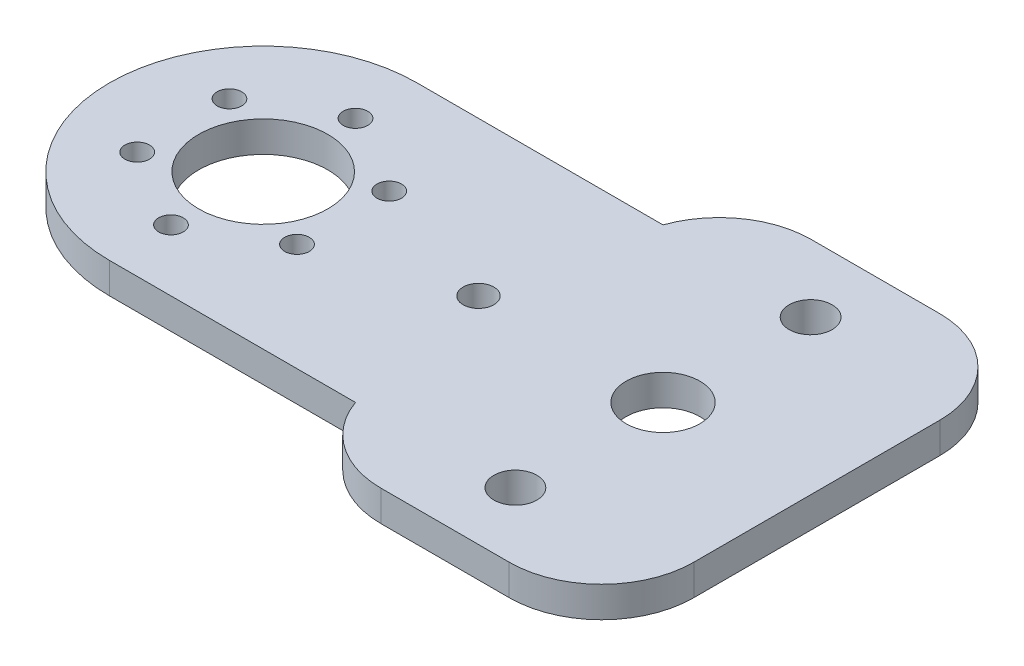
ISO-10303-21;
HEADER;
FILE_DESCRIPTION(('STEP AP214'),'2;1');
FILE_NAME('part.step','',(''),(''),'','','');
FILE_SCHEMA(('AUTOMOTIVE_DESIGN { 1 0 10303 214 1 1 1 1 }'));
ENDSEC;
DATA;
#1=APPLICATION_CONTEXT('core data for automotive mechanical design processes');
#2=APPLICATION_PROTOCOL_DEFINITION('international standard','automotive_design',2000,#1);
#3=PRODUCT_CONTEXT('',#1,'mechanical');
#4=PRODUCT('Part','Part','',(#3));
#5=PRODUCT_RELATED_PRODUCT_CATEGORY('part','',(#4));
#6=PRODUCT_DEFINITION_FORMATION('','',#4);
#7=PRODUCT_DEFINITION_CONTEXT('part definition',#1,'design');
#8=PRODUCT_DEFINITION('design','',#6,#7);
#9=PRODUCT_DEFINITION_SHAPE('','',#8);
#10=(LENGTH_UNIT() NAMED_UNIT(*) SI_UNIT(.MILLI.,.METRE.));
#11=(NAMED_UNIT(*) PLANE_ANGLE_UNIT() SI_UNIT($,.RADIAN.));
#12=(NAMED_UNIT(*) SI_UNIT($,.STERADIAN.) SOLID_ANGLE_UNIT());
#13=UNCERTAINTY_MEASURE_WITH_UNIT(LENGTH_MEASURE(1.E-05),#10,'distance_accuracy_value','');
#14=(GEOMETRIC_REPRESENTATION_CONTEXT(3) GLOBAL_UNCERTAINTY_ASSIGNED_CONTEXT((#13)) GLOBAL_UNIT_ASSIGNED_CONTEXT((#10,
#11,#12)) REPRESENTATION_CONTEXT('',''));
#15=CARTESIAN_POINT('',(0.,0.,0.));
#16=DIRECTION('',(0.,0.,1.));
#17=DIRECTION('',(1.,0.,0.));
#18=AXIS2_PLACEMENT_3D('',#15,#16,#17);
#19=CARTESIAN_POINT('',(90.,5.,0.));
#20=DIRECTION('',(-1.,0.,0.));
#21=DIRECTION('',(0.,0.,1.));
#22=AXIS2_PLACEMENT_3D('',#19,#20,#21);
#23=PLANE('',#22);
#24=DIRECTION('',(0.,0.,-1.));
#25=VECTOR('',#24,1.);
#26=CARTESIAN_POINT('',(90.,5.,0.));
#27=LINE('',#26,#25);
#28=CARTESIAN_POINT('',(90.,5.,20.));
#29=VERTEX_POINT('',#28);
#30=CARTESIAN_POINT('',(90.,5.,-20.));
#31=VERTEX_POINT('',#30);
#32=EDGE_CURVE('E170',#29,#31,#27,.T.);
#33=ORIENTED_EDGE('',*,*,#32,.F.);
#34=DIRECTION('',(0.,-1.,0.));
#35=VECTOR('',#34,1.);
#36=CARTESIAN_POINT('',(90.,5.,20.));
#37=LINE('',#36,#35);
#38=CARTESIAN_POINT('',(90.,0.,20.));
#39=VERTEX_POINT('',#38);
#40=EDGE_CURVE('E145',#29,#39,#37,.T.);
#41=ORIENTED_EDGE('',*,*,#40,.T.);
#42=DIRECTION('',(0.,0.,-1.));
#43=VECTOR('',#42,1.);
#44=CARTESIAN_POINT('',(90.,0.,0.));
#45=LINE('',#44,#43);
#46=CARTESIAN_POINT('',(90.,0.,-20.));
#47=VERTEX_POINT('',#46);
#48=EDGE_CURVE('E189',#39,#47,#45,.T.);
#49=ORIENTED_EDGE('',*,*,#48,.T.);
#50=DIRECTION('',(0.,-1.,0.));
#51=VECTOR('',#50,1.);
#52=CARTESIAN_POINT('',(90.,5.,-20.));
#53=LINE('',#52,#51);
#54=EDGE_CURVE('E143',#47,#31,#53,.F.);
#55=ORIENTED_EDGE('',*,*,#54,.T.);
#56=EDGE_LOOP('',(#33,#41,#49,#55));
#57=FACE_BOUND('',#56,.T.);
#58=ADVANCED_FACE('F43',(#57),#23,.F.);
#59=CARTESIAN_POINT('',(0.,5.,-35.));
#60=DIRECTION('',(0.,0.,-1.));
#61=DIRECTION('',(-1.,0.,0.));
#62=AXIS2_PLACEMENT_3D('',#59,#60,#61);
#63=PLANE('',#62);
#64=DIRECTION('',(1.,0.,0.));
#65=VECTOR('',#64,1.);
#66=CARTESIAN_POINT('',(0.,5.,-35.));
#67=LINE('',#66,#65);
#68=CARTESIAN_POINT('',(54.1421356237309,5.,-35.));
#69=VERTEX_POINT('',#68);
#70=CARTESIAN_POINT('',(75.,5.,-35.));
#71=VERTEX_POINT('',#70);
#72=EDGE_CURVE('E126',#69,#71,#67,.T.);
#73=ORIENTED_EDGE('',*,*,#72,.T.);
#74=DIRECTION('',(0.,-1.,0.));
#75=VECTOR('',#74,1.);
#76=CARTESIAN_POINT('',(75.,0.,-35.));
#77=LINE('',#76,#75);
#78=CARTESIAN_POINT('',(75.,0.,-35.));
#79=VERTEX_POINT('',#78);
#80=EDGE_CURVE('E11',#71,#79,#77,.T.);
#81=ORIENTED_EDGE('',*,*,#80,.T.);
#82=DIRECTION('',(1.,0.,0.));
#83=VECTOR('',#82,1.);
#84=CARTESIAN_POINT('',(0.,0.,-35.));
#85=LINE('',#84,#83);
#86=CARTESIAN_POINT('',(54.1421356237309,0.,-35.));
#87=VERTEX_POINT('',#86);
#88=EDGE_CURVE('E284',#87,#79,#85,.T.);
#89=ORIENTED_EDGE('',*,*,#88,.F.);
#90=DIRECTION('',(0.,1.,0.));
#91=VECTOR('',#90,1.);
#92=CARTESIAN_POINT('',(54.1421356237309,5.,-35.));
#93=LINE('',#92,#91);
#94=EDGE_CURVE('E51',#87,#69,#93,.T.);
#95=ORIENTED_EDGE('',*,*,#94,.T.);
#96=EDGE_LOOP('',(#73,#81,#89,#95));
#97=FACE_BOUND('',#96,.T.);
#98=ADVANCED_FACE('F291',(#97),#63,.T.);
#99=CARTESIAN_POINT('',(0.,5.,-25.));
#100=DIRECTION('',(0.,0.,-1.));
#101=DIRECTION('',(-1.,0.,0.));
#102=AXIS2_PLACEMENT_3D('',#99,#100,#101);
#103=PLANE('',#102);
#104=DIRECTION('',(1.,0.,0.));
#105=VECTOR('',#104,1.);
#106=CARTESIAN_POINT('',(0.,0.,-25.));
#107=LINE('',#106,#105);
#108=CARTESIAN_POINT('',(0.,0.,-25.));
#109=VERTEX_POINT('',#108);
#110=CARTESIAN_POINT('',(40.,0.,-25.));
#111=VERTEX_POINT('',#110);
#112=EDGE_CURVE('E287',#109,#111,#107,.T.);
#113=ORIENTED_EDGE('',*,*,#112,.F.);
#114=DIRECTION('',(0.,-1.,0.));
#115=VECTOR('',#114,1.);
#116=CARTESIAN_POINT('',(0.,5.,-25.));
#117=LINE('',#116,#115);
#118=CARTESIAN_POINT('',(0.,5.,-25.));
#119=VERTEX_POINT('',#118);
#120=EDGE_CURVE('E137',#119,#109,#117,.T.);
#121=ORIENTED_EDGE('',*,*,#120,.F.);
#122=DIRECTION('',(1.,0.,0.));
#123=VECTOR('',#122,1.);
#124=CARTESIAN_POINT('',(0.,5.,-25.));
#125=LINE('',#124,#123);
#126=CARTESIAN_POINT('',(40.,5.,-25.));
#127=VERTEX_POINT('',#126);
#128=EDGE_CURVE('E125',#119,#127,#125,.T.);
#129=ORIENTED_EDGE('',*,*,#128,.T.);
#130=DIRECTION('',(0.,-1.,0.));
#131=VECTOR('',#130,1.);
#132=CARTESIAN_POINT('',(40.,5.,-25.));
#133=LINE('',#132,#131);
#134=EDGE_CURVE('E135',#127,#111,#133,.T.);
#135=ORIENTED_EDGE('',*,*,#134,.T.);
#136=EDGE_LOOP('',(#113,#121,#129,#135));
#137=FACE_BOUND('',#136,.T.);
#138=ADVANCED_FACE('F134',(#137),#103,.T.);
#139=CARTESIAN_POINT('',(0.,5.,0.));
#140=DIRECTION('',(0.,-1.,0.));
#141=DIRECTION('',(0.,0.,-1.));
#142=AXIS2_PLACEMENT_3D('',#139,#140,#141);
#143=CYLINDRICAL_SURFACE('',#142,25.);
#144=CARTESIAN_POINT('',(0.,0.,0.));
#145=DIRECTION('',(0.,1.,0.));
#146=DIRECTION('',(0.,0.,1.));
#147=AXIS2_PLACEMENT_3D('',#144,#145,#146);
#148=CIRCLE('',#147,25.);
#149=CARTESIAN_POINT('',(0.,0.,25.));
#150=VERTEX_POINT('',#149);
#151=EDGE_CURVE('E200',#109,#150,#148,.T.);
#152=ORIENTED_EDGE('',*,*,#151,.T.);
#153=DIRECTION('',(0.,-1.,0.));
#154=VECTOR('',#153,1.);
#155=CARTESIAN_POINT('',(0.,5.,25.));
#156=LINE('',#155,#154);
#157=CARTESIAN_POINT('',(0.,5.,25.));
#158=VERTEX_POINT('',#157);
#159=EDGE_CURVE('E147',#158,#150,#156,.T.);
#160=ORIENTED_EDGE('',*,*,#159,.F.);
#161=CARTESIAN_POINT('',(0.,5.,0.));
#162=DIRECTION('',(0.,1.,0.));
#163=DIRECTION('',(0.,0.,1.));
#164=AXIS2_PLACEMENT_3D('',#161,#162,#163);
#165=CIRCLE('',#164,25.);
#166=EDGE_CURVE('E139',#119,#158,#165,.T.);
#167=ORIENTED_EDGE('',*,*,#166,.F.);
#168=ORIENTED_EDGE('',*,*,#120,.T.);
#169=EDGE_LOOP('',(#152,#160,#167,#168));
#170=FACE_BOUND('',#169,.T.);
#171=ADVANCED_FACE('F288',(#170),#143,.T.);
#172=CARTESIAN_POINT('',(0.,5.,25.));
#173=DIRECTION('',(0.,0.,-1.));
#174=DIRECTION('',(-1.,0.,0.));
#175=AXIS2_PLACEMENT_3D('',#172,#173,#174);
#176=PLANE('',#175);
#177=DIRECTION('',(1.,0.,0.));
#178=VECTOR('',#177,1.);
#179=CARTESIAN_POINT('',(0.,0.,25.));
#180=LINE('',#179,#178);
#181=CARTESIAN_POINT('',(40.,0.,25.));
#182=VERTEX_POINT('',#181);
#183=EDGE_CURVE('E194',#150,#182,#180,.T.);
#184=ORIENTED_EDGE('',*,*,#183,.T.);
#185=DIRECTION('',(0.,-1.,0.));
#186=VECTOR('',#185,1.);
#187=CARTESIAN_POINT('',(40.,5.,25.));
#188=LINE('',#187,#186);
#189=CARTESIAN_POINT('',(40.,5.,25.));
#190=VERTEX_POINT('',#189);
#191=EDGE_CURVE('E232',#190,#182,#188,.T.);
#192=ORIENTED_EDGE('',*,*,#191,.F.);
#193=DIRECTION('',(1.,0.,0.));
#194=VECTOR('',#193,1.);
#195=CARTESIAN_POINT('',(0.,5.,25.));
#196=LINE('',#195,#194);
#197=EDGE_CURVE('E242',#158,#190,#196,.T.);
#198=ORIENTED_EDGE('',*,*,#197,.F.);
#199=ORIENTED_EDGE('',*,*,#159,.T.);
#200=EDGE_LOOP('',(#184,#192,#198,#199));
#201=FACE_BOUND('',#200,.T.);
#202=ADVANCED_FACE('F240',(#201),#176,.F.);
#203=CARTESIAN_POINT('',(65.,5.,23.9999999999994));
#204=DIRECTION('',(0.,-1.,0.));
#205=DIRECTION('',(0.,0.,-1.));
#206=AXIS2_PLACEMENT_3D('',#203,#204,#205);
#207=CYLINDRICAL_SURFACE('',#206,3.50000000000213);
#208=CARTESIAN_POINT('',(65.,5.,23.9999999999994));
#209=DIRECTION('',(0.,1.,0.));
#210=DIRECTION('',(0.,0.,1.));
#211=AXIS2_PLACEMENT_3D('',#208,#209,#210);
#212=CIRCLE('',#211,3.50000000000213);
#213=CARTESIAN_POINT('',(65.,5.,27.5000000000015));
#214=VERTEX_POINT('',#213);
#215=EDGE_CURVE('E278',#214,#214,#212,.F.);
#216=ORIENTED_EDGE('',*,*,#215,.F.);
#217=EDGE_LOOP('',(#216));
#218=FACE_BOUND('',#217,.T.);
#219=CARTESIAN_POINT('',(65.,0.,23.9999999999994));
#220=DIRECTION('',(0.,1.,0.));
#221=DIRECTION('',(0.,0.,1.));
#222=AXIS2_PLACEMENT_3D('',#219,#220,#221);
#223=CIRCLE('',#222,3.50000000000213);
#224=CARTESIAN_POINT('',(65.,0.,27.5000000000015));
#225=VERTEX_POINT('',#224);
#226=EDGE_CURVE('E227',#225,#225,#223,.F.);
#227=ORIENTED_EDGE('',*,*,#226,.T.);
#228=EDGE_LOOP('',(#227));
#229=FACE_BOUND('',#228,.T.);
#230=ADVANCED_FACE('F315',(#218,#229),#207,.F.);
#231=CARTESIAN_POINT('',(-12.9903810567666,5.,-7.49999999999999));
#232=DIRECTION('',(0.,-1.,0.));
#233=DIRECTION('',(0.,0.,-1.));
#234=AXIS2_PLACEMENT_3D('',#231,#232,#233);
#235=CYLINDRICAL_SURFACE('',#234,2.00000000000019);
#236=CARTESIAN_POINT('',(-12.9903810567666,5.,-7.49999999999999));
#237=DIRECTION('',(0.,1.,0.));
#238=DIRECTION('',(0.,0.,1.));
#239=AXIS2_PLACEMENT_3D('',#236,#237,#238);
#240=CIRCLE('',#239,2.00000000000019);
#241=CARTESIAN_POINT('',(-12.9903810567666,5.,-5.49999999999979));
#242=VERTEX_POINT('',#241);
#243=EDGE_CURVE('E275',#242,#242,#240,.T.);
#244=ORIENTED_EDGE('',*,*,#243,.T.);
#245=EDGE_LOOP('',(#244));
#246=FACE_BOUND('',#245,.T.);
#247=CARTESIAN_POINT('',(-12.9903810567666,0.,-7.49999999999999));
#248=DIRECTION('',(0.,1.,0.));
#249=DIRECTION('',(0.,0.,1.));
#250=AXIS2_PLACEMENT_3D('',#247,#248,#249);
#251=CIRCLE('',#250,2.00000000000019);
#252=CARTESIAN_POINT('',(-12.9903810567666,0.,-5.49999999999979));
#253=VERTEX_POINT('',#252);
#254=EDGE_CURVE('E224',#253,#253,#251,.T.);
#255=ORIENTED_EDGE('',*,*,#254,.F.);
#256=EDGE_LOOP('',(#255));
#257=FACE_BOUND('',#256,.T.);
#258=ADVANCED_FACE('F350',(#246,#257),#235,.F.);
#259=CARTESIAN_POINT('',(-12.9903810567666,5.,7.50000000000004));
#260=DIRECTION('',(0.,-1.,0.));
#261=DIRECTION('',(0.,0.,-1.));
#262=AXIS2_PLACEMENT_3D('',#259,#260,#261);
#263=CYLINDRICAL_SURFACE('',#262,2.00000000000012);
#264=CARTESIAN_POINT('',(-12.9903810567666,5.,7.50000000000004));
#265=DIRECTION('',(0.,1.,0.));
#266=DIRECTION('',(0.,0.,1.));
#267=AXIS2_PLACEMENT_3D('',#264,#265,#266);
#268=CIRCLE('',#267,2.00000000000012);
#269=CARTESIAN_POINT('',(-12.9903810567666,5.,9.50000000000017));
#270=VERTEX_POINT('',#269);
#271=EDGE_CURVE('E272',#270,#270,#268,.T.);
#272=ORIENTED_EDGE('',*,*,#271,.T.);
#273=EDGE_LOOP('',(#272));
#274=FACE_BOUND('',#273,.T.);
#275=CARTESIAN_POINT('',(-12.9903810567666,0.,7.50000000000004));
#276=DIRECTION('',(0.,1.,0.));
#277=DIRECTION('',(0.,0.,1.));
#278=AXIS2_PLACEMENT_3D('',#275,#276,#277);
#279=CIRCLE('',#278,2.00000000000012);
#280=CARTESIAN_POINT('',(-12.9903810567666,0.,9.50000000000017));
#281=VERTEX_POINT('',#280);
#282=EDGE_CURVE('E221',#281,#281,#279,.T.);
#283=ORIENTED_EDGE('',*,*,#282,.F.);
#284=EDGE_LOOP('',(#283));
#285=FACE_BOUND('',#284,.T.);
#286=ADVANCED_FACE('F346',(#274,#285),#263,.F.);
#287=CARTESIAN_POINT('',(0.,5.,15.0000000000001));
#288=DIRECTION('',(0.,-1.,0.));
#289=DIRECTION('',(0.,0.,-1.));
#290=AXIS2_PLACEMENT_3D('',#287,#288,#289);
#291=CYLINDRICAL_SURFACE('',#290,2.00000000000004);
#292=CARTESIAN_POINT('',(0.,5.,15.0000000000001));
#293=DIRECTION('',(0.,1.,0.));
#294=DIRECTION('',(0.,0.,1.));
#295=AXIS2_PLACEMENT_3D('',#292,#293,#294);
#296=CIRCLE('',#295,2.00000000000004);
#297=CARTESIAN_POINT('',(0.,5.,17.0000000000001));
#298=VERTEX_POINT('',#297);
#299=EDGE_CURVE('E269',#298,#298,#296,.T.);
#300=ORIENTED_EDGE('',*,*,#299,.T.);
#301=EDGE_LOOP('',(#300));
#302=FACE_BOUND('',#301,.T.);
#303=CARTESIAN_POINT('',(0.,0.,15.0000000000001));
#304=DIRECTION('',(0.,1.,0.));
#305=DIRECTION('',(0.,0.,1.));
#306=AXIS2_PLACEMENT_3D('',#303,#304,#305);
#307=CIRCLE('',#306,2.00000000000004);
#308=CARTESIAN_POINT('',(0.,0.,17.0000000000001));
#309=VERTEX_POINT('',#308);
#310=EDGE_CURVE('E218',#309,#309,#307,.T.);
#311=ORIENTED_EDGE('',*,*,#310,.F.);
#312=EDGE_LOOP('',(#311));
#313=FACE_BOUND('',#312,.T.);
#314=ADVANCED_FACE('F342',(#302,#313),#291,.F.);
#315=CARTESIAN_POINT('',(12.9903810567665,5.,7.50000000000006));
#316=DIRECTION('',(0.,-1.,0.));
#317=DIRECTION('',(0.,0.,-1.));
#318=AXIS2_PLACEMENT_3D('',#315,#316,#317);
#319=CYLINDRICAL_SURFACE('',#318,2.);
#320=CARTESIAN_POINT('',(12.9903810567665,5.,7.50000000000006));
#321=DIRECTION('',(0.,1.,0.));
#322=DIRECTION('',(0.,0.,1.));
#323=AXIS2_PLACEMENT_3D('',#320,#321,#322);
#324=CIRCLE('',#323,2.);
#325=CARTESIAN_POINT('',(12.9903810567665,5.,9.50000000000006));
#326=VERTEX_POINT('',#325);
#327=EDGE_CURVE('E266',#326,#326,#324,.T.);
#328=ORIENTED_EDGE('',*,*,#327,.T.);
#329=EDGE_LOOP('',(#328));
#330=FACE_BOUND('',#329,.T.);
#331=CARTESIAN_POINT('',(12.9903810567665,0.,7.50000000000006));
#332=DIRECTION('',(0.,1.,0.));
#333=DIRECTION('',(0.,0.,1.));
#334=AXIS2_PLACEMENT_3D('',#331,#332,#333);
#335=CIRCLE('',#334,2.);
#336=CARTESIAN_POINT('',(12.9903810567665,0.,9.50000000000006));
#337=VERTEX_POINT('',#336);
#338=EDGE_CURVE('E215',#337,#337,#335,.T.);
#339=ORIENTED_EDGE('',*,*,#338,.F.);
#340=EDGE_LOOP('',(#339));
#341=FACE_BOUND('',#340,.T.);
#342=ADVANCED_FACE('F338',(#330,#341),#319,.F.);
#343=CARTESIAN_POINT('',(12.9903810567666,5.,-7.49999999999997));
#344=DIRECTION('',(0.,-1.,0.));
#345=DIRECTION('',(0.,0.,-1.));
#346=AXIS2_PLACEMENT_3D('',#343,#344,#345);
#347=CYLINDRICAL_SURFACE('',#346,2.);
#348=CARTESIAN_POINT('',(12.9903810567666,5.,-7.49999999999997));
#349=DIRECTION('',(0.,1.,0.));
#350=DIRECTION('',(0.,0.,1.));
#351=AXIS2_PLACEMENT_3D('',#348,#349,#350);
#352=CIRCLE('',#351,2.);
#353=CARTESIAN_POINT('',(12.9903810567666,5.,-5.49999999999997));
#354=VERTEX_POINT('',#353);
#355=EDGE_CURVE('E263',#354,#354,#352,.T.);
#356=ORIENTED_EDGE('',*,*,#355,.T.);
#357=EDGE_LOOP('',(#356));
#358=FACE_BOUND('',#357,.T.);
#359=CARTESIAN_POINT('',(12.9903810567666,0.,-7.49999999999997));
#360=DIRECTION('',(0.,1.,0.));
#361=DIRECTION('',(0.,0.,1.));
#362=AXIS2_PLACEMENT_3D('',#359,#360,#361);
#363=CIRCLE('',#362,2.);
#364=CARTESIAN_POINT('',(12.9903810567666,0.,-5.49999999999997));
#365=VERTEX_POINT('',#364);
#366=EDGE_CURVE('E212',#365,#365,#363,.T.);
#367=ORIENTED_EDGE('',*,*,#366,.F.);
#368=EDGE_LOOP('',(#367));
#369=FACE_BOUND('',#368,.T.);
#370=ADVANCED_FACE('F334',(#358,#369),#347,.F.);
#371=CARTESIAN_POINT('',(0.,5.,-15.));
#372=DIRECTION('',(0.,-1.,0.));
#373=DIRECTION('',(0.,0.,-1.));
#374=AXIS2_PLACEMENT_3D('',#371,#372,#373);
#375=CYLINDRICAL_SURFACE('',#374,2.);
#376=CARTESIAN_POINT('',(0.,5.,-15.));
#377=DIRECTION('',(0.,1.,0.));
#378=DIRECTION('',(0.,0.,1.));
#379=AXIS2_PLACEMENT_3D('',#376,#377,#378);
#380=CIRCLE('',#379,2.);
#381=CARTESIAN_POINT('',(0.,5.,-13.));
#382=VERTEX_POINT('',#381);
#383=EDGE_CURVE('E260',#382,#382,#380,.T.);
#384=ORIENTED_EDGE('',*,*,#383,.T.);
#385=EDGE_LOOP('',(#384));
#386=FACE_BOUND('',#385,.T.);
#387=CARTESIAN_POINT('',(0.,0.,-15.));
#388=DIRECTION('',(0.,1.,0.));
#389=DIRECTION('',(0.,0.,1.));
#390=AXIS2_PLACEMENT_3D('',#387,#388,#389);
#391=CIRCLE('',#390,2.);
#392=CARTESIAN_POINT('',(0.,0.,-13.));
#393=VERTEX_POINT('',#392);
#394=EDGE_CURVE('E209',#393,#393,#391,.T.);
#395=ORIENTED_EDGE('',*,*,#394,.F.);
#396=EDGE_LOOP('',(#395));
#397=FACE_BOUND('',#396,.T.);
#398=ADVANCED_FACE('F330',(#386,#397),#375,.F.);
#399=CARTESIAN_POINT('',(0.,5.,0.));
#400=DIRECTION('',(0.,-1.,0.));
#401=DIRECTION('',(0.,0.,-1.));
#402=AXIS2_PLACEMENT_3D('',#399,#400,#401);
#403=CYLINDRICAL_SURFACE('',#402,10.5);
#404=CARTESIAN_POINT('',(0.,5.,0.));
#405=DIRECTION('',(0.,1.,0.));
#406=DIRECTION('',(0.,0.,1.));
#407=AXIS2_PLACEMENT_3D('',#404,#405,#406);
#408=CIRCLE('',#407,10.5);
#409=CARTESIAN_POINT('',(0.,5.,10.5));
#410=VERTEX_POINT('',#409);
#411=EDGE_CURVE('E257',#410,#410,#408,.T.);
#412=ORIENTED_EDGE('',*,*,#411,.T.);
#413=EDGE_LOOP('',(#412));
#414=FACE_BOUND('',#413,.T.);
#415=CARTESIAN_POINT('',(0.,0.,0.));
#416=DIRECTION('',(0.,1.,0.));
#417=DIRECTION('',(0.,0.,1.));
#418=AXIS2_PLACEMENT_3D('',#415,#416,#417);
#419=CIRCLE('',#418,10.5);
#420=CARTESIAN_POINT('',(0.,0.,10.5));
#421=VERTEX_POINT('',#420);
#422=EDGE_CURVE('E206',#421,#421,#419,.T.);
#423=ORIENTED_EDGE('',*,*,#422,.F.);
#424=EDGE_LOOP('',(#423));
#425=FACE_BOUND('',#424,.T.);
#426=ADVANCED_FACE('F326',(#414,#425),#403,.F.);
#427=CARTESIAN_POINT('',(35.,5.,0.));
#428=DIRECTION('',(0.,-1.,0.));
#429=DIRECTION('',(0.,0.,-1.));
#430=AXIS2_PLACEMENT_3D('',#427,#428,#429);
#431=CYLINDRICAL_SURFACE('',#430,2.5);
#432=CARTESIAN_POINT('',(35.,5.,0.));
#433=DIRECTION('',(0.,1.,0.));
#434=DIRECTION('',(0.,0.,1.));
#435=AXIS2_PLACEMENT_3D('',#432,#433,#434);
#436=CIRCLE('',#435,2.5);
#437=CARTESIAN_POINT('',(35.,5.,2.5));
#438=VERTEX_POINT('',#437);
#439=EDGE_CURVE('E250',#438,#438,#436,.T.);
#440=ORIENTED_EDGE('',*,*,#439,.T.);
#441=EDGE_LOOP('',(#440));
#442=FACE_BOUND('',#441,.T.);
#443=CARTESIAN_POINT('',(35.,0.,0.));
#444=DIRECTION('',(0.,1.,0.));
#445=DIRECTION('',(0.,0.,1.));
#446=AXIS2_PLACEMENT_3D('',#443,#444,#445);
#447=CIRCLE('',#446,2.5);
#448=CARTESIAN_POINT('',(35.,0.,2.5));
#449=VERTEX_POINT('',#448);
#450=EDGE_CURVE('E197',#449,#449,#447,.T.);
#451=ORIENTED_EDGE('',*,*,#450,.F.);
#452=EDGE_LOOP('',(#451));
#453=FACE_BOUND('',#452,.T.);
#454=ADVANCED_FACE('F322',(#442,#453),#431,.F.);
#455=CARTESIAN_POINT('',(65.,5.,-23.9999999999994));
#456=DIRECTION('',(0.,-1.,0.));
#457=DIRECTION('',(0.,0.,-1.));
#458=AXIS2_PLACEMENT_3D('',#455,#456,#457);
#459=CYLINDRICAL_SURFACE('',#458,3.50000000000213);
#460=CARTESIAN_POINT('',(65.,5.,-23.9999999999994));
#461=DIRECTION('',(0.,1.,0.));
#462=DIRECTION('',(0.,0.,1.));
#463=AXIS2_PLACEMENT_3D('',#460,#461,#462);
#464=CIRCLE('',#463,3.50000000000213);
#465=CARTESIAN_POINT('',(65.,5.,-20.4999999999972));
#466=VERTEX_POINT('',#465);
#467=EDGE_CURVE('E247',#466,#466,#464,.T.);
#468=ORIENTED_EDGE('',*,*,#467,.T.);
#469=EDGE_LOOP('',(#468));
#470=FACE_BOUND('',#469,.T.);
#471=CARTESIAN_POINT('',(65.,0.,-23.9999999999994));
#472=DIRECTION('',(0.,1.,0.));
#473=DIRECTION('',(0.,0.,1.));
#474=AXIS2_PLACEMENT_3D('',#471,#472,#473);
#475=CIRCLE('',#474,3.50000000000213);
#476=CARTESIAN_POINT('',(65.,0.,-20.4999999999972));
#477=VERTEX_POINT('',#476);
#478=EDGE_CURVE('E193',#477,#477,#475,.T.);
#479=ORIENTED_EDGE('',*,*,#478,.F.);
#480=EDGE_LOOP('',(#479));
#481=FACE_BOUND('',#480,.T.);
#482=ADVANCED_FACE('F319',(#470,#481),#459,.F.);
#483=CARTESIAN_POINT('',(0.,5.,35.));
#484=DIRECTION('',(0.,0.,-1.));
#485=DIRECTION('',(-1.,0.,0.));
#486=AXIS2_PLACEMENT_3D('',#483,#484,#485);
#487=PLANE('',#486);
#488=DIRECTION('',(1.,0.,0.));
#489=VECTOR('',#488,1.);
#490=CARTESIAN_POINT('',(0.,0.,35.));
#491=LINE('',#490,#489);
#492=CARTESIAN_POINT('',(54.1421356237309,0.,35.));
#493=VERTEX_POINT('',#492);
#494=CARTESIAN_POINT('',(75.,0.,35.));
#495=VERTEX_POINT('',#494);
#496=EDGE_CURVE('E188',#493,#495,#491,.T.);
#497=ORIENTED_EDGE('',*,*,#496,.T.);
#498=DIRECTION('',(0.,-1.,0.));
#499=VECTOR('',#498,1.);
#500=CARTESIAN_POINT('',(75.,5.,35.));
#501=LINE('',#500,#499);
#502=CARTESIAN_POINT('',(75.,5.,35.));
#503=VERTEX_POINT('',#502);
#504=EDGE_CURVE('E163',#495,#503,#501,.F.);
#505=ORIENTED_EDGE('',*,*,#504,.T.);
#506=DIRECTION('',(1.,0.,0.));
#507=VECTOR('',#506,1.);
#508=CARTESIAN_POINT('',(0.,5.,35.));
#509=LINE('',#508,#507);
#510=CARTESIAN_POINT('',(54.1421356237309,5.,35.));
#511=VERTEX_POINT('',#510);
#512=EDGE_CURVE('E172',#511,#503,#509,.T.);
#513=ORIENTED_EDGE('',*,*,#512,.F.);
#514=DIRECTION('',(0.,-1.,0.));
#515=VECTOR('',#514,1.);
#516=CARTESIAN_POINT('',(54.1421356237309,5.,35.));
#517=LINE('',#516,#515);
#518=EDGE_CURVE('E160',#511,#493,#517,.T.);
#519=ORIENTED_EDGE('',*,*,#518,.T.);
#520=EDGE_LOOP('',(#497,#505,#513,#519));
#521=FACE_BOUND('',#520,.T.);
#522=ADVANCED_FACE('F191',(#521),#487,.F.);
#523=CARTESIAN_POINT('',(65.,5.,0.));
#524=DIRECTION('',(0.,-1.,0.));
#525=DIRECTION('',(0.,0.,-1.));
#526=AXIS2_PLACEMENT_3D('',#523,#524,#525);
#527=CYLINDRICAL_SURFACE('',#526,6.);
#528=CARTESIAN_POINT('',(65.,5.,0.));
#529=DIRECTION('',(0.,1.,0.));
#530=DIRECTION('',(0.,0.,1.));
#531=AXIS2_PLACEMENT_3D('',#528,#529,#530);
#532=CIRCLE('',#531,6.);
#533=CARTESIAN_POINT('',(65.,5.,6.));
#534=VERTEX_POINT('',#533);
#535=EDGE_CURVE('E234',#534,#534,#532,.T.);
#536=ORIENTED_EDGE('',*,*,#535,.T.);
#537=EDGE_LOOP('',(#536));
#538=FACE_BOUND('',#537,.T.);
#539=CARTESIAN_POINT('',(65.,0.,0.));
#540=DIRECTION('',(0.,1.,0.));
#541=DIRECTION('',(0.,0.,1.));
#542=AXIS2_PLACEMENT_3D('',#539,#540,#541);
#543=CIRCLE('',#542,6.);
#544=CARTESIAN_POINT('',(65.,0.,6.));
#545=VERTEX_POINT('',#544);
#546=EDGE_CURVE('E180',#545,#545,#543,.T.);
#547=ORIENTED_EDGE('',*,*,#546,.F.);
#548=EDGE_LOOP('',(#547));
#549=FACE_BOUND('',#548,.T.);
#550=ADVANCED_FACE('F318',(#538,#549),#527,.F.);
#551=CARTESIAN_POINT('',(0.,5.,0.));
#552=DIRECTION('',(0.,1.,0.));
#553=DIRECTION('',(0.,0.,1.));
#554=AXIS2_PLACEMENT_3D('',#551,#552,#553);
#555=PLANE('',#554);
#556=ORIENTED_EDGE('',*,*,#512,.T.);
#557=CARTESIAN_POINT('',(75.,5.,20.));
#558=DIRECTION('',(0.,1.,0.));
#559=DIRECTION('',(0.,0.,1.));
#560=AXIS2_PLACEMENT_3D('',#557,#558,#559);
#561=CIRCLE('',#560,15.);
#562=EDGE_CURVE('E167',#503,#29,#561,.T.);
#563=ORIENTED_EDGE('',*,*,#562,.T.);
#564=ORIENTED_EDGE('',*,*,#32,.T.);
#565=CARTESIAN_POINT('',(75.,5.,-20.));
#566=DIRECTION('',(0.,1.,0.));
#567=DIRECTION('',(0.,0.,1.));
#568=AXIS2_PLACEMENT_3D('',#565,#566,#567);
#569=CIRCLE('',#568,15.);
#570=EDGE_CURVE('E58',#31,#71,#569,.T.);
#571=ORIENTED_EDGE('',*,*,#570,.T.);
#572=ORIENTED_EDGE('',*,*,#72,.F.);
#573=CARTESIAN_POINT('',(54.1421356237309,5.,-20.));
#574=DIRECTION('',(0.,1.,0.));
#575=DIRECTION('',(0.,0.,1.));
#576=AXIS2_PLACEMENT_3D('',#573,#574,#575);
#577=CIRCLE('',#576,15.);
#578=EDGE_CURVE('E120',#69,#127,#577,.T.);
#579=ORIENTED_EDGE('',*,*,#578,.T.);
#580=ORIENTED_EDGE('',*,*,#128,.F.);
#581=ORIENTED_EDGE('',*,*,#166,.T.);
#582=ORIENTED_EDGE('',*,*,#197,.T.);
#583=CARTESIAN_POINT('',(54.1421356237309,5.,20.));
#584=DIRECTION('',(0.,1.,0.));
#585=DIRECTION('',(0.,0.,1.));
#586=AXIS2_PLACEMENT_3D('',#583,#584,#585);
#587=CIRCLE('',#586,15.);
#588=EDGE_CURVE('E129',#190,#511,#587,.T.);
#589=ORIENTED_EDGE('',*,*,#588,.T.);
#590=EDGE_LOOP('',(#556,#563,#564,#571,#572,#579,#580,#581,#582,#589));
#591=FACE_BOUND('',#590,.T.);
#592=ORIENTED_EDGE('',*,*,#467,.F.);
#593=EDGE_LOOP('',(#592));
#594=FACE_BOUND('',#593,.T.);
#595=ORIENTED_EDGE('',*,*,#439,.F.);
#596=EDGE_LOOP('',(#595));
#597=FACE_BOUND('',#596,.T.);
#598=ORIENTED_EDGE('',*,*,#411,.F.);
#599=EDGE_LOOP('',(#598));
#600=FACE_BOUND('',#599,.T.);
#601=ORIENTED_EDGE('',*,*,#383,.F.);
#602=EDGE_LOOP('',(#601));
#603=FACE_BOUND('',#602,.T.);
#604=ORIENTED_EDGE('',*,*,#355,.F.);
#605=EDGE_LOOP('',(#604));
#606=FACE_BOUND('',#605,.T.);
#607=ORIENTED_EDGE('',*,*,#327,.F.);
#608=EDGE_LOOP('',(#607));
#609=FACE_BOUND('',#608,.T.);
#610=ORIENTED_EDGE('',*,*,#299,.F.);
#611=EDGE_LOOP('',(#610));
#612=FACE_BOUND('',#611,.T.);
#613=ORIENTED_EDGE('',*,*,#271,.F.);
#614=EDGE_LOOP('',(#613));
#615=FACE_BOUND('',#614,.T.);
#616=ORIENTED_EDGE('',*,*,#243,.F.);
#617=EDGE_LOOP('',(#616));
#618=FACE_BOUND('',#617,.T.);
#619=ORIENTED_EDGE('',*,*,#215,.T.);
#620=EDGE_LOOP('',(#619));
#621=FACE_BOUND('',#620,.T.);
#622=ORIENTED_EDGE('',*,*,#535,.F.);
#623=EDGE_LOOP('',(#622));
#624=FACE_BOUND('',#623,.T.);
#625=ADVANCED_FACE('F123',(#591,#594,#597,#600,#603,#606,#609,#612,#615,#618,#621,#624),#555,.T.);
#626=CARTESIAN_POINT('',(0.,0.,0.));
#627=DIRECTION('',(0.,1.,0.));
#628=DIRECTION('',(0.,0.,1.));
#629=AXIS2_PLACEMENT_3D('',#626,#627,#628);
#630=PLANE('',#629);
#631=ORIENTED_EDGE('',*,*,#48,.F.);
#632=CARTESIAN_POINT('',(75.,0.,20.));
#633=DIRECTION('',(0.,1.,0.));
#634=DIRECTION('',(0.,0.,1.));
#635=AXIS2_PLACEMENT_3D('',#632,#633,#634);
#636=CIRCLE('',#635,15.);
#637=EDGE_CURVE('E158',#39,#495,#636,.F.);
#638=ORIENTED_EDGE('',*,*,#637,.T.);
#639=ORIENTED_EDGE('',*,*,#496,.F.);
#640=CARTESIAN_POINT('',(54.1421356237309,0.,20.));
#641=DIRECTION('',(0.,1.,0.));
#642=DIRECTION('',(0.,0.,1.));
#643=AXIS2_PLACEMENT_3D('',#640,#641,#642);
#644=CIRCLE('',#643,15.);
#645=EDGE_CURVE('E153',#493,#182,#644,.F.);
#646=ORIENTED_EDGE('',*,*,#645,.T.);
#647=ORIENTED_EDGE('',*,*,#183,.F.);
#648=ORIENTED_EDGE('',*,*,#151,.F.);
#649=ORIENTED_EDGE('',*,*,#112,.T.);
#650=CARTESIAN_POINT('',(54.1421356237309,0.,-20.));
#651=DIRECTION('',(0.,1.,0.));
#652=DIRECTION('',(0.,0.,1.));
#653=AXIS2_PLACEMENT_3D('',#650,#651,#652);
#654=CIRCLE('',#653,15.);
#655=EDGE_CURVE('E142',#111,#87,#654,.F.);
#656=ORIENTED_EDGE('',*,*,#655,.T.);
#657=ORIENTED_EDGE('',*,*,#88,.T.);
#658=CARTESIAN_POINT('',(75.,0.,-20.));
#659=DIRECTION('',(0.,1.,0.));
#660=DIRECTION('',(0.,0.,1.));
#661=AXIS2_PLACEMENT_3D('',#658,#659,#660);
#662=CIRCLE('',#661,15.);
#663=EDGE_CURVE('E156',#79,#47,#662,.F.);
#664=ORIENTED_EDGE('',*,*,#663,.T.);
#665=EDGE_LOOP('',(#631,#638,#639,#646,#647,#648,#649,#656,#657,#664));
#666=FACE_BOUND('',#665,.T.);
#667=ORIENTED_EDGE('',*,*,#478,.T.);
#668=EDGE_LOOP('',(#667));
#669=FACE_BOUND('',#668,.T.);
#670=ORIENTED_EDGE('',*,*,#450,.T.);
#671=EDGE_LOOP('',(#670));
#672=FACE_BOUND('',#671,.T.);
#673=ORIENTED_EDGE('',*,*,#422,.T.);
#674=EDGE_LOOP('',(#673));
#675=FACE_BOUND('',#674,.T.);
#676=ORIENTED_EDGE('',*,*,#394,.T.);
#677=EDGE_LOOP('',(#676));
#678=FACE_BOUND('',#677,.T.);
#679=ORIENTED_EDGE('',*,*,#366,.T.);
#680=EDGE_LOOP('',(#679));
#681=FACE_BOUND('',#680,.T.);
#682=ORIENTED_EDGE('',*,*,#338,.T.);
#683=EDGE_LOOP('',(#682));
#684=FACE_BOUND('',#683,.T.);
#685=ORIENTED_EDGE('',*,*,#310,.T.);
#686=EDGE_LOOP('',(#685));
#687=FACE_BOUND('',#686,.T.);
#688=ORIENTED_EDGE('',*,*,#282,.T.);
#689=EDGE_LOOP('',(#688));
#690=FACE_BOUND('',#689,.T.);
#691=ORIENTED_EDGE('',*,*,#254,.T.);
#692=EDGE_LOOP('',(#691));
#693=FACE_BOUND('',#692,.T.);
#694=ORIENTED_EDGE('',*,*,#226,.F.);
#695=EDGE_LOOP('',(#694));
#696=FACE_BOUND('',#695,.T.);
#697=ORIENTED_EDGE('',*,*,#546,.T.);
#698=EDGE_LOOP('',(#697));
#699=FACE_BOUND('',#698,.T.);
#700=ADVANCED_FACE('F186',(#666,#669,#672,#675,#678,#681,#684,#687,#690,#693,#696,#699),#630,.F.);
#701=CARTESIAN_POINT('',(75.,5.,20.));
#702=DIRECTION('',(0.,-1.,0.));
#703=DIRECTION('',(0.,0.,-1.));
#704=AXIS2_PLACEMENT_3D('',#701,#702,#703);
#705=CYLINDRICAL_SURFACE('',#704,15.);
#706=ORIENTED_EDGE('',*,*,#562,.F.);
#707=ORIENTED_EDGE('',*,*,#504,.F.);
#708=ORIENTED_EDGE('',*,*,#637,.F.);
#709=ORIENTED_EDGE('',*,*,#40,.F.);
#710=EDGE_LOOP('',(#706,#707,#708,#709));
#711=FACE_BOUND('',#710,.T.);
#712=ADVANCED_FACE('F182',(#711),#705,.T.);
#713=CARTESIAN_POINT('',(75.,5.,-20.));
#714=DIRECTION('',(0.,1.,0.));
#715=DIRECTION('',(0.,0.,1.));
#716=AXIS2_PLACEMENT_3D('',#713,#714,#715);
#717=CYLINDRICAL_SURFACE('',#716,15.);
#718=ORIENTED_EDGE('',*,*,#570,.F.);
#719=ORIENTED_EDGE('',*,*,#54,.F.);
#720=ORIENTED_EDGE('',*,*,#663,.F.);
#721=ORIENTED_EDGE('',*,*,#80,.F.);
#722=EDGE_LOOP('',(#718,#719,#720,#721));
#723=FACE_BOUND('',#722,.T.);
#724=ADVANCED_FACE('F293',(#723),#717,.T.);
#725=CARTESIAN_POINT('',(54.1421356237309,5.,-20.));
#726=DIRECTION('',(0.,-1.,0.));
#727=DIRECTION('',(0.,0.,-1.));
#728=AXIS2_PLACEMENT_3D('',#725,#726,#727);
#729=CYLINDRICAL_SURFACE('',#728,15.);
#730=ORIENTED_EDGE('',*,*,#578,.F.);
#731=ORIENTED_EDGE('',*,*,#94,.F.);
#732=ORIENTED_EDGE('',*,*,#655,.F.);
#733=ORIENTED_EDGE('',*,*,#134,.F.);
#734=EDGE_LOOP('',(#730,#731,#732,#733));
#735=FACE_BOUND('',#734,.T.);
#736=ADVANCED_FACE('F141',(#735),#729,.T.);
#737=CARTESIAN_POINT('',(54.1421356237309,5.,20.));
#738=DIRECTION('',(0.,-1.,0.));
#739=DIRECTION('',(0.,0.,-1.));
#740=AXIS2_PLACEMENT_3D('',#737,#738,#739);
#741=CYLINDRICAL_SURFACE('',#740,15.);
#742=ORIENTED_EDGE('',*,*,#588,.F.);
#743=ORIENTED_EDGE('',*,*,#191,.T.);
#744=ORIENTED_EDGE('',*,*,#645,.F.);
#745=ORIENTED_EDGE('',*,*,#518,.F.);
#746=EDGE_LOOP('',(#742,#743,#744,#745));
#747=FACE_BOUND('',#746,.T.);
#748=ADVANCED_FACE('F45',(#747),#741,.T.);
#749=CLOSED_SHELL('',(#58,#98,#138,#171,#202,#230,#258,#286,#314,#342,#370,#398,#426,#454,#482,
#522,#550,#625,#700,#712,#724,#736,#748));
#750=MANIFOLD_SOLID_BREP('B2',#749);
#751=ADVANCED_BREP_SHAPE_REPRESENTATION('',(#18,#750),#14);
#752=SHAPE_DEFINITION_REPRESENTATION(#9,#751);
ENDSEC;
END-ISO-10303-21;
